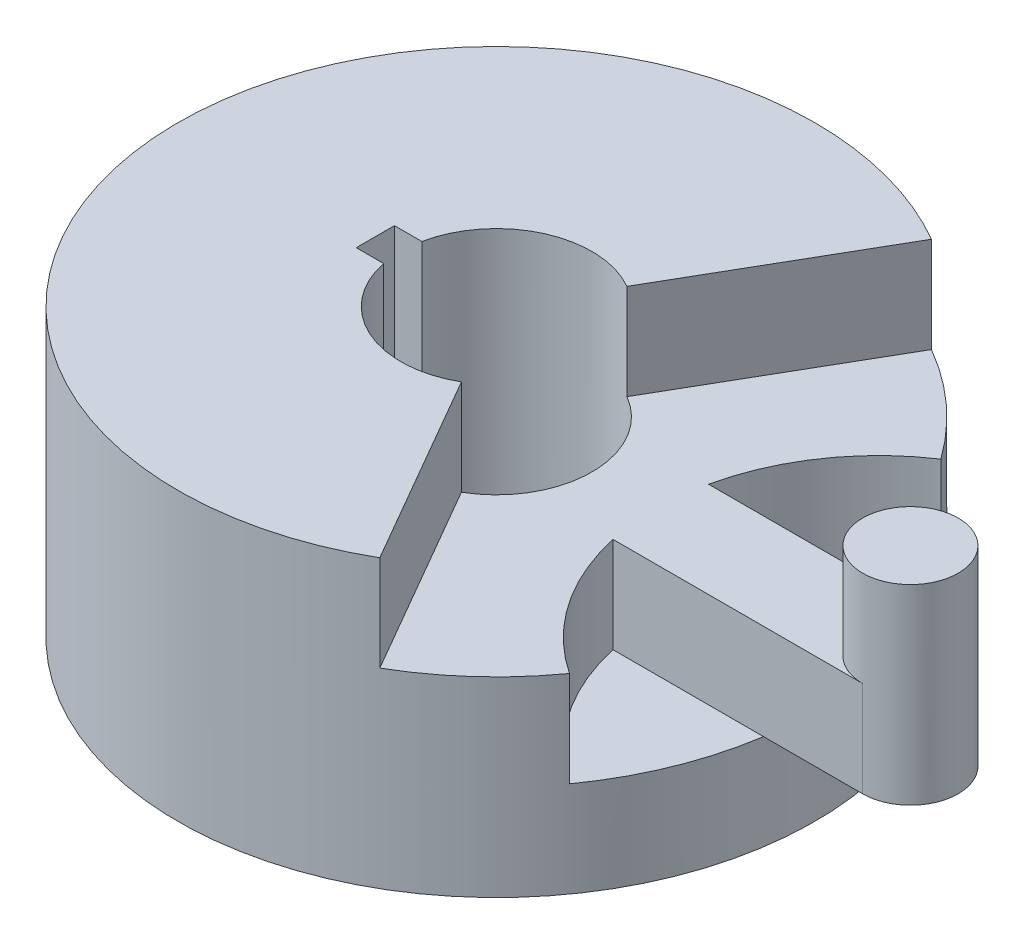
ISO-10303-21;
HEADER;
FILE_DESCRIPTION(('STEP AP214'),'2;1');
FILE_NAME('part.step','',(''),(''),'','','');
FILE_SCHEMA(('AUTOMOTIVE_DESIGN { 1 0 10303 214 1 1 1 1 }'));
ENDSEC;
DATA;
#1=APPLICATION_CONTEXT('core data for automotive mechanical design processes');
#2=APPLICATION_PROTOCOL_DEFINITION('international standard','automotive_design',2000,#1);
#3=PRODUCT_CONTEXT('',#1,'mechanical');
#4=PRODUCT('Part','Part','',(#3));
#5=PRODUCT_RELATED_PRODUCT_CATEGORY('part','',(#4));
#6=PRODUCT_DEFINITION_FORMATION('','',#4);
#7=PRODUCT_DEFINITION_CONTEXT('part definition',#1,'design');
#8=PRODUCT_DEFINITION('design','',#6,#7);
#9=PRODUCT_DEFINITION_SHAPE('','',#8);
#10=(LENGTH_UNIT() NAMED_UNIT(*) SI_UNIT(.MILLI.,.METRE.));
#11=(NAMED_UNIT(*) PLANE_ANGLE_UNIT() SI_UNIT($,.RADIAN.));
#12=(NAMED_UNIT(*) SI_UNIT($,.STERADIAN.) SOLID_ANGLE_UNIT());
#13=UNCERTAINTY_MEASURE_WITH_UNIT(LENGTH_MEASURE(1.E-05),#10,'distance_accuracy_value','');
#14=(GEOMETRIC_REPRESENTATION_CONTEXT(3) GLOBAL_UNCERTAINTY_ASSIGNED_CONTEXT((#13)) GLOBAL_UNIT_ASSIGNED_CONTEXT((#10,
#11,#12)) REPRESENTATION_CONTEXT('',''));
#15=CARTESIAN_POINT('',(0.,0.,0.));
#16=DIRECTION('',(0.,0.,1.));
#17=DIRECTION('',(1.,0.,0.));
#18=AXIS2_PLACEMENT_3D('',#15,#16,#17);
#19=CARTESIAN_POINT('',(60.,15.,0.));
#20=DIRECTION('',(0.,-1.,0.));
#21=DIRECTION('',(0.,0.,-1.));
#22=AXIS2_PLACEMENT_3D('',#19,#20,#21);
#23=CYLINDRICAL_SURFACE('',#22,35.);
#24=CARTESIAN_POINT('',(60.,0.,0.));
#25=DIRECTION('',(0.,-1.,0.));
#26=DIRECTION('',(0.,0.,1.));
#27=AXIS2_PLACEMENT_3D('',#24,#25,#26);
#28=CIRCLE('',#27,35.);
#29=CARTESIAN_POINT('',(40.625,0.,29.1480595409025));
#30=VERTEX_POINT('',#29);
#31=CARTESIAN_POINT('',(25.8130141720566,0.,7.5));
#32=VERTEX_POINT('',#31);
#33=EDGE_CURVE('E187',#30,#32,#28,.T.);
#34=ORIENTED_EDGE('',*,*,#33,.F.);
#35=DIRECTION('',(0.,-1.,0.));
#36=VECTOR('',#35,1.);
#37=CARTESIAN_POINT('',(40.625,15.,29.1480595409025));
#38=LINE('',#37,#36);
#39=CARTESIAN_POINT('',(40.625,-15.,29.1480595409025));
#40=VERTEX_POINT('',#39);
#41=EDGE_CURVE('E59',#30,#40,#38,.T.);
#42=ORIENTED_EDGE('',*,*,#41,.T.);
#43=CARTESIAN_POINT('',(60.,-15.,0.));
#44=DIRECTION('',(0.,-1.,0.));
#45=DIRECTION('',(0.,0.,1.));
#46=AXIS2_PLACEMENT_3D('',#43,#44,#45);
#47=CIRCLE('',#46,35.);
#48=CARTESIAN_POINT('',(25.8130141720566,-15.,7.5));
#49=VERTEX_POINT('',#48);
#50=EDGE_CURVE('E249',#40,#49,#47,.T.);
#51=ORIENTED_EDGE('',*,*,#50,.T.);
#52=DIRECTION('',(0.,1.,0.));
#53=VECTOR('',#52,1.);
#54=CARTESIAN_POINT('',(25.8130141720566,-15.,7.5));
#55=LINE('',#54,#53);
#56=EDGE_CURVE('E234',#49,#32,#55,.T.);
#57=ORIENTED_EDGE('',*,*,#56,.T.);
#58=EDGE_LOOP('',(#34,#42,#51,#57));
#59=FACE_BOUND('',#58,.T.);
#60=ADVANCED_FACE('F37',(#59),#23,.F.);
#61=CARTESIAN_POINT('',(25.8130141720567,0.,-7.5));
#62=VERTEX_POINT('',#61);
#63=CARTESIAN_POINT('',(40.625,0.,-29.1480595409025));
#64=VERTEX_POINT('',#63);
#65=EDGE_CURVE('E186',#62,#64,#28,.T.);
#66=ORIENTED_EDGE('',*,*,#65,.F.);
#67=DIRECTION('',(0.,1.,0.));
#68=VECTOR('',#67,1.);
#69=CARTESIAN_POINT('',(25.8130141720566,-15.,-7.5));
#70=LINE('',#69,#68);
#71=CARTESIAN_POINT('',(25.8130141720566,-15.,-7.5));
#72=VERTEX_POINT('',#71);
#73=EDGE_CURVE('E237',#72,#62,#70,.T.);
#74=ORIENTED_EDGE('',*,*,#73,.F.);
#75=CARTESIAN_POINT('',(40.625,-15.,-29.1480595409025));
#76=VERTEX_POINT('',#75);
#77=EDGE_CURVE('E245',#72,#76,#47,.T.);
#78=ORIENTED_EDGE('',*,*,#77,.T.);
#79=DIRECTION('',(0.,-1.,0.));
#80=VECTOR('',#79,1.);
#81=CARTESIAN_POINT('',(40.625,15.,-29.1480595409025));
#82=LINE('',#81,#80);
#83=EDGE_CURVE('E252',#64,#76,#82,.T.);
#84=ORIENTED_EDGE('',*,*,#83,.F.);
#85=EDGE_LOOP('',(#66,#74,#78,#84));
#86=FACE_BOUND('',#85,.T.);
#87=ADVANCED_FACE('F302',(#86),#23,.F.);
#88=CARTESIAN_POINT('',(30.,-15.,0.));
#89=DIRECTION('',(0.,1.,0.));
#90=DIRECTION('',(0.,0.,1.));
#91=AXIS2_PLACEMENT_3D('',#88,#89,#90);
#92=PLANE('',#91);
#93=CARTESIAN_POINT('',(0.,-15.,0.));
#94=DIRECTION('',(0.,-1.,0.));
#95=DIRECTION('',(0.,0.,-1.));
#96=AXIS2_PLACEMENT_3D('',#93,#94,#95);
#97=CIRCLE('',#96,50.);
#98=CARTESIAN_POINT('',(49.434299833213,-15.,-7.5));
#99=VERTEX_POINT('',#98);
#100=CARTESIAN_POINT('',(49.434299833213,-15.,7.5));
#101=VERTEX_POINT('',#100);
#102=EDGE_CURVE('E210',#99,#101,#97,.T.);
#103=ORIENTED_EDGE('',*,*,#102,.F.);
#104=DIRECTION('',(-1.,0.,0.));
#105=VECTOR('',#104,1.);
#106=CARTESIAN_POINT('',(65.,-15.,-7.5));
#107=LINE('',#106,#105);
#108=CARTESIAN_POINT('',(65.,-15.,-7.5));
#109=VERTEX_POINT('',#108);
#110=EDGE_CURVE('E219',#109,#99,#107,.T.);
#111=ORIENTED_EDGE('',*,*,#110,.F.);
#112=CARTESIAN_POINT('',(65.,-15.,0.));
#113=DIRECTION('',(0.,1.,0.));
#114=DIRECTION('',(0.,0.,1.));
#115=AXIS2_PLACEMENT_3D('',#112,#113,#114);
#116=CIRCLE('',#115,7.5);
#117=CARTESIAN_POINT('',(65.,-15.,7.5));
#118=VERTEX_POINT('',#117);
#119=EDGE_CURVE('E214',#118,#109,#116,.T.);
#120=ORIENTED_EDGE('',*,*,#119,.F.);
#121=DIRECTION('',(1.,0.,0.));
#122=VECTOR('',#121,1.);
#123=CARTESIAN_POINT('',(65.,-15.,7.5));
#124=LINE('',#123,#122);
#125=EDGE_CURVE('E222',#101,#118,#124,.T.);
#126=ORIENTED_EDGE('',*,*,#125,.F.);
#127=EDGE_LOOP('',(#103,#111,#120,#126));
#128=FACE_BOUND('',#127,.T.);
#129=ADVANCED_FACE('F326',(#128),#92,.F.);
#130=CARTESIAN_POINT('',(30.,15.,0.));
#131=DIRECTION('',(0.,1.,0.));
#132=DIRECTION('',(0.,0.,1.));
#133=AXIS2_PLACEMENT_3D('',#130,#131,#132);
#134=PLANE('',#133);
#135=DIRECTION('',(1.,0.,0.));
#136=VECTOR('',#135,1.);
#137=CARTESIAN_POINT('',(-19.,15.,3.));
#138=LINE('',#137,#136);
#139=CARTESIAN_POINT('',(-19.,15.,3.));
#140=VERTEX_POINT('',#139);
#141=CARTESIAN_POINT('',(-14.6969384566991,15.,3.));
#142=VERTEX_POINT('',#141);
#143=EDGE_CURVE('E165',#140,#142,#138,.T.);
#144=ORIENTED_EDGE('',*,*,#143,.F.);
#145=DIRECTION('',(0.,0.,1.));
#146=VECTOR('',#145,1.);
#147=CARTESIAN_POINT('',(-19.,15.,-3.));
#148=LINE('',#147,#146);
#149=CARTESIAN_POINT('',(-19.,15.,-3.));
#150=VERTEX_POINT('',#149);
#151=EDGE_CURVE('E147',#150,#140,#148,.T.);
#152=ORIENTED_EDGE('',*,*,#151,.F.);
#153=DIRECTION('',(-1.,0.,0.));
#154=VECTOR('',#153,1.);
#155=CARTESIAN_POINT('',(-19.,15.,-3.));
#156=LINE('',#155,#154);
#157=CARTESIAN_POINT('',(-14.6969384566991,15.,-3.));
#158=VERTEX_POINT('',#157);
#159=EDGE_CURVE('E169',#158,#150,#156,.T.);
#160=ORIENTED_EDGE('',*,*,#159,.F.);
#161=CARTESIAN_POINT('',(0.,15.,0.));
#162=DIRECTION('',(0.,1.,0.));
#163=DIRECTION('',(0.,0.,1.));
#164=AXIS2_PLACEMENT_3D('',#161,#162,#163);
#165=CIRCLE('',#164,15.);
#166=CARTESIAN_POINT('',(7.49999999999997,15.,-12.9903810567666));
#167=VERTEX_POINT('',#166);
#168=EDGE_CURVE('E242',#167,#158,#165,.T.);
#169=ORIENTED_EDGE('',*,*,#168,.F.);
#170=DIRECTION('',(-0.499999999999998,0.,0.86602540378444));
#171=VECTOR('',#170,1.);
#172=CARTESIAN_POINT('',(0.,15.,0.));
#173=LINE('',#172,#171);
#174=CARTESIAN_POINT('',(24.9999999999999,15.,-43.301270189222));
#175=VERTEX_POINT('',#174);
#176=EDGE_CURVE('E177',#175,#167,#173,.T.);
#177=ORIENTED_EDGE('',*,*,#176,.F.);
#178=CARTESIAN_POINT('',(0.,15.,0.));
#179=DIRECTION('',(0.,1.,0.));
#180=DIRECTION('',(0.,0.,1.));
#181=AXIS2_PLACEMENT_3D('',#178,#179,#180);
#182=CIRCLE('',#181,50.);
#183=CARTESIAN_POINT('',(24.9999999999999,15.,43.301270189222));
#184=VERTEX_POINT('',#183);
#185=EDGE_CURVE('E246',#175,#184,#182,.T.);
#186=ORIENTED_EDGE('',*,*,#185,.T.);
#187=DIRECTION('',(0.499999999999998,0.,0.86602540378444));
#188=VECTOR('',#187,1.);
#189=CARTESIAN_POINT('',(0.,15.,0.));
#190=LINE('',#189,#188);
#191=CARTESIAN_POINT('',(7.49999999999997,15.,12.9903810567666));
#192=VERTEX_POINT('',#191);
#193=EDGE_CURVE('E182',#192,#184,#190,.T.);
#194=ORIENTED_EDGE('',*,*,#193,.F.);
#195=EDGE_CURVE('E233',#142,#192,#165,.T.);
#196=ORIENTED_EDGE('',*,*,#195,.F.);
#197=EDGE_LOOP('',(#144,#152,#160,#169,#177,#186,#194,#196));
#198=FACE_BOUND('',#197,.T.);
#199=ADVANCED_FACE('F278',(#198),#134,.T.);
#200=CARTESIAN_POINT('',(0.,15.,0.));
#201=DIRECTION('',(0.,-1.,0.));
#202=DIRECTION('',(0.,0.,-1.));
#203=AXIS2_PLACEMENT_3D('',#200,#201,#202);
#204=CYLINDRICAL_SURFACE('',#203,50.);
#205=CARTESIAN_POINT('',(0.,0.,0.));
#206=DIRECTION('',(0.,1.,0.));
#207=DIRECTION('',(0.,0.,1.));
#208=AXIS2_PLACEMENT_3D('',#205,#206,#207);
#209=CIRCLE('',#208,50.);
#210=CARTESIAN_POINT('',(24.9999999999999,0.,43.301270189222));
#211=VERTEX_POINT('',#210);
#212=EDGE_CURVE('E184',#211,#30,#209,.T.);
#213=ORIENTED_EDGE('',*,*,#212,.F.);
#214=DIRECTION('',(0.,1.,0.));
#215=VECTOR('',#214,1.);
#216=CARTESIAN_POINT('',(24.9999999999999,0.,43.301270189222));
#217=LINE('',#216,#215);
#218=EDGE_CURVE('E192',#211,#184,#217,.T.);
#219=ORIENTED_EDGE('',*,*,#218,.T.);
#220=ORIENTED_EDGE('',*,*,#185,.F.);
#221=DIRECTION('',(0.,1.,0.));
#222=VECTOR('',#221,1.);
#223=CARTESIAN_POINT('',(24.9999999999999,0.,-43.301270189222));
#224=LINE('',#223,#222);
#225=CARTESIAN_POINT('',(24.9999999999999,0.,-43.301270189222));
#226=VERTEX_POINT('',#225);
#227=EDGE_CURVE('E195',#226,#175,#224,.T.);
#228=ORIENTED_EDGE('',*,*,#227,.F.);
#229=CARTESIAN_POINT('',(0.,0.,0.));
#230=DIRECTION('',(0.,1.,0.));
#231=DIRECTION('',(0.,0.,1.));
#232=AXIS2_PLACEMENT_3D('',#229,#230,#231);
#233=CIRCLE('',#232,50.);
#234=EDGE_CURVE('E189',#64,#226,#233,.T.);
#235=ORIENTED_EDGE('',*,*,#234,.F.);
#236=ORIENTED_EDGE('',*,*,#83,.T.);
#237=EDGE_CURVE('E207',#76,#99,#97,.T.);
#238=ORIENTED_EDGE('',*,*,#237,.T.);
#239=ORIENTED_EDGE('',*,*,#102,.T.);
#240=EDGE_CURVE('E202',#101,#40,#97,.T.);
#241=ORIENTED_EDGE('',*,*,#240,.T.);
#242=ORIENTED_EDGE('',*,*,#41,.F.);
#243=EDGE_LOOP('',(#213,#219,#220,#228,#235,#236,#238,#239,#241,#242));
#244=FACE_BOUND('',#243,.T.);
#245=CARTESIAN_POINT('',(0.,-30.,0.));
#246=DIRECTION('',(0.,-1.,0.));
#247=DIRECTION('',(0.,0.,-1.));
#248=AXIS2_PLACEMENT_3D('',#245,#246,#247);
#249=CIRCLE('',#248,50.);
#250=CARTESIAN_POINT('',(0.,-30.,-50.));
#251=VERTEX_POINT('',#250);
#252=EDGE_CURVE('E203',#251,#251,#249,.T.);
#253=ORIENTED_EDGE('',*,*,#252,.F.);
#254=EDGE_LOOP('',(#253));
#255=FACE_BOUND('',#254,.T.);
#256=ADVANCED_FACE('F282',(#244,#255),#204,.T.);
#257=CARTESIAN_POINT('',(0.,15.,0.));
#258=DIRECTION('',(0.,-1.,0.));
#259=DIRECTION('',(0.,0.,-1.));
#260=AXIS2_PLACEMENT_3D('',#257,#258,#259);
#261=CYLINDRICAL_SURFACE('',#260,15.);
#262=DIRECTION('',(0.,-1.,0.));
#263=VECTOR('',#262,1.);
#264=CARTESIAN_POINT('',(-14.6969384566991,15.,3.));
#265=LINE('',#264,#263);
#266=CARTESIAN_POINT('',(-14.6969384566991,-30.,3.));
#267=VERTEX_POINT('',#266);
#268=EDGE_CURVE('E157',#142,#267,#265,.T.);
#269=ORIENTED_EDGE('',*,*,#268,.F.);
#270=ORIENTED_EDGE('',*,*,#195,.T.);
#271=DIRECTION('',(0.,-1.,0.));
#272=VECTOR('',#271,1.);
#273=CARTESIAN_POINT('',(7.49999999999997,15.,12.9903810567666));
#274=LINE('',#273,#272);
#275=CARTESIAN_POINT('',(7.49999999999997,0.,12.9903810567666));
#276=VERTEX_POINT('',#275);
#277=EDGE_CURVE('E257',#276,#192,#274,.F.);
#278=ORIENTED_EDGE('',*,*,#277,.F.);
#279=CARTESIAN_POINT('',(0.,0.,0.));
#280=DIRECTION('',(0.,1.,0.));
#281=DIRECTION('',(0.,0.,1.));
#282=AXIS2_PLACEMENT_3D('',#279,#280,#281);
#283=CIRCLE('',#282,15.);
#284=CARTESIAN_POINT('',(7.49999999999997,0.,-12.9903810567666));
#285=VERTEX_POINT('',#284);
#286=EDGE_CURVE('E197',#276,#285,#283,.T.);
#287=ORIENTED_EDGE('',*,*,#286,.T.);
#288=DIRECTION('',(0.,-1.,0.));
#289=VECTOR('',#288,1.);
#290=CARTESIAN_POINT('',(7.49999999999997,15.,-12.9903810567666));
#291=LINE('',#290,#289);
#292=EDGE_CURVE('E44',#167,#285,#291,.T.);
#293=ORIENTED_EDGE('',*,*,#292,.F.);
#294=ORIENTED_EDGE('',*,*,#168,.T.);
#295=DIRECTION('',(0.,-1.,0.));
#296=VECTOR('',#295,1.);
#297=CARTESIAN_POINT('',(-14.6969384566991,15.,-3.));
#298=LINE('',#297,#296);
#299=CARTESIAN_POINT('',(-14.6969384566991,-30.,-3.));
#300=VERTEX_POINT('',#299);
#301=EDGE_CURVE('E150',#300,#158,#298,.F.);
#302=ORIENTED_EDGE('',*,*,#301,.F.);
#303=CARTESIAN_POINT('',(0.,-30.,0.));
#304=DIRECTION('',(0.,1.,0.));
#305=DIRECTION('',(0.,0.,1.));
#306=AXIS2_PLACEMENT_3D('',#303,#304,#305);
#307=CIRCLE('',#306,15.);
#308=EDGE_CURVE('E175',#267,#300,#307,.T.);
#309=ORIENTED_EDGE('',*,*,#308,.F.);
#310=EDGE_LOOP('',(#269,#270,#278,#287,#293,#294,#302,#309));
#311=FACE_BOUND('',#310,.T.);
#312=ADVANCED_FACE('F271',(#311),#261,.F.);
#313=CARTESIAN_POINT('',(65.,-15.,0.));
#314=DIRECTION('',(0.,1.,0.));
#315=DIRECTION('',(0.,0.,1.));
#316=AXIS2_PLACEMENT_3D('',#313,#314,#315);
#317=CYLINDRICAL_SURFACE('',#316,7.5);
#318=DIRECTION('',(0.,1.,0.));
#319=VECTOR('',#318,1.);
#320=CARTESIAN_POINT('',(65.,-15.,-7.5));
#321=LINE('',#320,#319);
#322=CARTESIAN_POINT('',(65.,0.,-7.5));
#323=VERTEX_POINT('',#322);
#324=EDGE_CURVE('E226',#109,#323,#321,.T.);
#325=ORIENTED_EDGE('',*,*,#324,.T.);
#326=CARTESIAN_POINT('',(65.,0.,0.));
#327=DIRECTION('',(0.,1.,0.));
#328=DIRECTION('',(0.,0.,1.));
#329=AXIS2_PLACEMENT_3D('',#326,#327,#328);
#330=CIRCLE('',#329,7.50000000000001);
#331=CARTESIAN_POINT('',(65.,0.,7.5));
#332=VERTEX_POINT('',#331);
#333=EDGE_CURVE('E254',#323,#332,#330,.T.);
#334=ORIENTED_EDGE('',*,*,#333,.T.);
#335=DIRECTION('',(0.,1.,0.));
#336=VECTOR('',#335,1.);
#337=CARTESIAN_POINT('',(65.,-15.,7.5));
#338=LINE('',#337,#336);
#339=EDGE_CURVE('E230',#118,#332,#338,.T.);
#340=ORIENTED_EDGE('',*,*,#339,.F.);
#341=ORIENTED_EDGE('',*,*,#119,.T.);
#342=EDGE_LOOP('',(#325,#334,#340,#341));
#343=FACE_BOUND('',#342,.T.);
#344=CARTESIAN_POINT('',(65.,15.,0.));
#345=DIRECTION('',(0.,1.,0.));
#346=DIRECTION('',(0.,0.,1.));
#347=AXIS2_PLACEMENT_3D('',#344,#345,#346);
#348=CIRCLE('',#347,7.50000000000001);
#349=CARTESIAN_POINT('',(65.,15.,7.50000000000001));
#350=VERTEX_POINT('',#349);
#351=EDGE_CURVE('E206',#350,#350,#348,.T.);
#352=ORIENTED_EDGE('',*,*,#351,.F.);
#353=EDGE_LOOP('',(#352));
#354=FACE_BOUND('',#353,.T.);
#355=ADVANCED_FACE('F292',(#343,#354),#317,.T.);
#356=CARTESIAN_POINT('',(65.,-15.,7.5));
#357=DIRECTION('',(0.,0.,1.));
#358=DIRECTION('',(1.,0.,0.));
#359=AXIS2_PLACEMENT_3D('',#356,#357,#358);
#360=PLANE('',#359);
#361=DIRECTION('',(1.,0.,0.));
#362=VECTOR('',#361,1.);
#363=CARTESIAN_POINT('',(65.,0.,7.5));
#364=LINE('',#363,#362);
#365=EDGE_CURVE('E218',#32,#332,#364,.T.);
#366=ORIENTED_EDGE('',*,*,#365,.F.);
#367=ORIENTED_EDGE('',*,*,#56,.F.);
#368=EDGE_CURVE('E223',#49,#101,#124,.T.);
#369=ORIENTED_EDGE('',*,*,#368,.T.);
#370=ORIENTED_EDGE('',*,*,#125,.T.);
#371=ORIENTED_EDGE('',*,*,#339,.T.);
#372=EDGE_LOOP('',(#366,#367,#369,#370,#371));
#373=FACE_BOUND('',#372,.T.);
#374=ADVANCED_FACE('F288',(#373),#360,.T.);
#375=CARTESIAN_POINT('',(65.,-15.,-7.5));
#376=DIRECTION('',(0.,0.,-1.));
#377=DIRECTION('',(-1.,0.,0.));
#378=AXIS2_PLACEMENT_3D('',#375,#376,#377);
#379=PLANE('',#378);
#380=DIRECTION('',(-1.,0.,0.));
#381=VECTOR('',#380,1.);
#382=CARTESIAN_POINT('',(65.,0.,-7.5));
#383=LINE('',#382,#381);
#384=EDGE_CURVE('E213',#323,#62,#383,.T.);
#385=ORIENTED_EDGE('',*,*,#384,.F.);
#386=ORIENTED_EDGE('',*,*,#324,.F.);
#387=ORIENTED_EDGE('',*,*,#110,.T.);
#388=EDGE_CURVE('E217',#99,#72,#107,.T.);
#389=ORIENTED_EDGE('',*,*,#388,.T.);
#390=ORIENTED_EDGE('',*,*,#73,.T.);
#391=EDGE_LOOP('',(#385,#386,#387,#389,#390));
#392=FACE_BOUND('',#391,.T.);
#393=ADVANCED_FACE('F297',(#392),#379,.T.);
#394=CARTESIAN_POINT('',(65.,0.,0.));
#395=DIRECTION('',(0.,1.,0.));
#396=DIRECTION('',(0.,0.,1.));
#397=AXIS2_PLACEMENT_3D('',#394,#395,#396);
#398=PLANE('',#397);
#399=ORIENTED_EDGE('',*,*,#333,.F.);
#400=ORIENTED_EDGE('',*,*,#384,.T.);
#401=ORIENTED_EDGE('',*,*,#65,.T.);
#402=ORIENTED_EDGE('',*,*,#234,.T.);
#403=DIRECTION('',(-0.499999999999998,0.,0.86602540378444));
#404=VECTOR('',#403,1.);
#405=CARTESIAN_POINT('',(0.,0.,0.));
#406=LINE('',#405,#404);
#407=EDGE_CURVE('E178',#226,#285,#406,.T.);
#408=ORIENTED_EDGE('',*,*,#407,.T.);
#409=ORIENTED_EDGE('',*,*,#286,.F.);
#410=DIRECTION('',(0.499999999999998,0.,0.86602540378444));
#411=VECTOR('',#410,1.);
#412=CARTESIAN_POINT('',(0.,0.,0.));
#413=LINE('',#412,#411);
#414=EDGE_CURVE('E181',#276,#211,#413,.T.);
#415=ORIENTED_EDGE('',*,*,#414,.T.);
#416=ORIENTED_EDGE('',*,*,#212,.T.);
#417=ORIENTED_EDGE('',*,*,#33,.T.);
#418=ORIENTED_EDGE('',*,*,#365,.T.);
#419=EDGE_LOOP('',(#399,#400,#401,#402,#408,#409,#415,#416,#417,#418));
#420=FACE_BOUND('',#419,.T.);
#421=ADVANCED_FACE('F266',(#420),#398,.T.);
#422=CARTESIAN_POINT('',(65.,15.,0.));
#423=DIRECTION('',(0.,1.,0.));
#424=DIRECTION('',(0.,0.,1.));
#425=AXIS2_PLACEMENT_3D('',#422,#423,#424);
#426=PLANE('',#425);
#427=ORIENTED_EDGE('',*,*,#351,.T.);
#428=EDGE_LOOP('',(#427));
#429=FACE_BOUND('',#428,.T.);
#430=ADVANCED_FACE('F310',(#429),#426,.T.);
#431=CARTESIAN_POINT('',(0.,-15.,0.));
#432=DIRECTION('',(0.,-1.,0.));
#433=DIRECTION('',(0.,0.,-1.));
#434=AXIS2_PLACEMENT_3D('',#431,#432,#433);
#435=PLANE('',#434);
#436=ORIENTED_EDGE('',*,*,#388,.F.);
#437=ORIENTED_EDGE('',*,*,#237,.F.);
#438=ORIENTED_EDGE('',*,*,#77,.F.);
#439=EDGE_LOOP('',(#436,#437,#438));
#440=FACE_BOUND('',#439,.T.);
#441=ADVANCED_FACE('F308',(#440),#435,.F.);
#442=CARTESIAN_POINT('',(0.,-30.,0.));
#443=DIRECTION('',(0.,-1.,0.));
#444=DIRECTION('',(0.,0.,-1.));
#445=AXIS2_PLACEMENT_3D('',#442,#443,#444);
#446=PLANE('',#445);
#447=DIRECTION('',(1.,0.,0.));
#448=VECTOR('',#447,1.);
#449=CARTESIAN_POINT('',(-19.,-30.,3.));
#450=LINE('',#449,#448);
#451=CARTESIAN_POINT('',(-19.,-30.,3.));
#452=VERTEX_POINT('',#451);
#453=EDGE_CURVE('E154',#452,#267,#450,.T.);
#454=ORIENTED_EDGE('',*,*,#453,.T.);
#455=ORIENTED_EDGE('',*,*,#308,.T.);
#456=DIRECTION('',(1.,0.,0.));
#457=VECTOR('',#456,1.);
#458=CARTESIAN_POINT('',(0.,-30.,-3.));
#459=LINE('',#458,#457);
#460=CARTESIAN_POINT('',(-19.,-30.,-3.));
#461=VERTEX_POINT('',#460);
#462=EDGE_CURVE('E11',#461,#300,#459,.T.);
#463=ORIENTED_EDGE('',*,*,#462,.F.);
#464=DIRECTION('',(0.,0.,1.));
#465=VECTOR('',#464,1.);
#466=CARTESIAN_POINT('',(-19.,-30.,-3.));
#467=LINE('',#466,#465);
#468=EDGE_CURVE('E51',#461,#452,#467,.T.);
#469=ORIENTED_EDGE('',*,*,#468,.T.);
#470=EDGE_LOOP('',(#454,#455,#463,#469));
#471=FACE_BOUND('',#470,.T.);
#472=ORIENTED_EDGE('',*,*,#252,.T.);
#473=EDGE_LOOP('',(#472));
#474=FACE_BOUND('',#473,.T.);
#475=ADVANCED_FACE('F163',(#471,#474),#446,.T.);
#476=ORIENTED_EDGE('',*,*,#368,.F.);
#477=ORIENTED_EDGE('',*,*,#50,.F.);
#478=ORIENTED_EDGE('',*,*,#240,.F.);
#479=EDGE_LOOP('',(#476,#477,#478));
#480=FACE_BOUND('',#479,.T.);
#481=ADVANCED_FACE('F312',(#480),#435,.F.);
#482=CARTESIAN_POINT('',(0.,0.,0.));
#483=DIRECTION('',(-0.86602540378444,0.,-0.499999999999998));
#484=DIRECTION('',(-0.499999999999998,0.,0.86602540378444));
#485=AXIS2_PLACEMENT_3D('',#482,#483,#484);
#486=PLANE('',#485);
#487=ORIENTED_EDGE('',*,*,#292,.T.);
#488=ORIENTED_EDGE('',*,*,#407,.F.);
#489=ORIENTED_EDGE('',*,*,#227,.T.);
#490=ORIENTED_EDGE('',*,*,#176,.T.);
#491=EDGE_LOOP('',(#487,#488,#489,#490));
#492=FACE_BOUND('',#491,.T.);
#493=ADVANCED_FACE('F261',(#492),#486,.F.);
#494=CARTESIAN_POINT('',(0.,0.,0.));
#495=DIRECTION('',(-0.86602540378444,0.,0.499999999999998));
#496=DIRECTION('',(0.499999999999998,0.,0.86602540378444));
#497=AXIS2_PLACEMENT_3D('',#494,#495,#496);
#498=PLANE('',#497);
#499=ORIENTED_EDGE('',*,*,#277,.T.);
#500=ORIENTED_EDGE('',*,*,#193,.T.);
#501=ORIENTED_EDGE('',*,*,#218,.F.);
#502=ORIENTED_EDGE('',*,*,#414,.F.);
#503=EDGE_LOOP('',(#499,#500,#501,#502));
#504=FACE_BOUND('',#503,.T.);
#505=ADVANCED_FACE('F275',(#504),#498,.F.);
#506=CARTESIAN_POINT('',(-19.,-30.,3.));
#507=DIRECTION('',(0.,0.,1.));
#508=DIRECTION('',(1.,0.,0.));
#509=AXIS2_PLACEMENT_3D('',#506,#507,#508);
#510=PLANE('',#509);
#511=ORIENTED_EDGE('',*,*,#268,.T.);
#512=ORIENTED_EDGE('',*,*,#453,.F.);
#513=DIRECTION('',(0.,1.,0.));
#514=VECTOR('',#513,1.);
#515=CARTESIAN_POINT('',(-19.,-30.,3.));
#516=LINE('',#515,#514);
#517=EDGE_CURVE('E143',#452,#140,#516,.T.);
#518=ORIENTED_EDGE('',*,*,#517,.T.);
#519=ORIENTED_EDGE('',*,*,#143,.T.);
#520=EDGE_LOOP('',(#511,#512,#518,#519));
#521=FACE_BOUND('',#520,.T.);
#522=ADVANCED_FACE('F155',(#521),#510,.F.);
#523=CARTESIAN_POINT('',(-19.,-30.,-3.));
#524=DIRECTION('',(-1.,0.,0.));
#525=DIRECTION('',(0.,0.,1.));
#526=AXIS2_PLACEMENT_3D('',#523,#524,#525);
#527=PLANE('',#526);
#528=ORIENTED_EDGE('',*,*,#151,.T.);
#529=ORIENTED_EDGE('',*,*,#517,.F.);
#530=ORIENTED_EDGE('',*,*,#468,.F.);
#531=DIRECTION('',(0.,1.,0.));
#532=VECTOR('',#531,1.);
#533=CARTESIAN_POINT('',(-19.,-30.,-3.));
#534=LINE('',#533,#532);
#535=EDGE_CURVE('E151',#461,#150,#534,.T.);
#536=ORIENTED_EDGE('',*,*,#535,.T.);
#537=EDGE_LOOP('',(#528,#529,#530,#536));
#538=FACE_BOUND('',#537,.T.);
#539=ADVANCED_FACE('F145',(#538),#527,.F.);
#540=CARTESIAN_POINT('',(-19.,-30.,-3.));
#541=DIRECTION('',(0.,0.,-1.));
#542=DIRECTION('',(-1.,0.,0.));
#543=AXIS2_PLACEMENT_3D('',#540,#541,#542);
#544=PLANE('',#543);
#545=ORIENTED_EDGE('',*,*,#301,.T.);
#546=ORIENTED_EDGE('',*,*,#159,.T.);
#547=ORIENTED_EDGE('',*,*,#535,.F.);
#548=ORIENTED_EDGE('',*,*,#462,.T.);
#549=EDGE_LOOP('',(#545,#546,#547,#548));
#550=FACE_BOUND('',#549,.T.);
#551=ADVANCED_FACE('F455',(#550),#544,.F.);
#552=CLOSED_SHELL('',(#60,#87,#129,#199,#256,#312,#355,#374,#393,#421,#430,#441,#475,#481,#493,
#505,#522,#539,#551));
#553=MANIFOLD_SOLID_BREP('B2',#552);
#554=ADVANCED_BREP_SHAPE_REPRESENTATION('',(#18,#553),#14);
#555=SHAPE_DEFINITION_REPRESENTATION(#9,#554);
ENDSEC;
END-ISO-10303-21;
